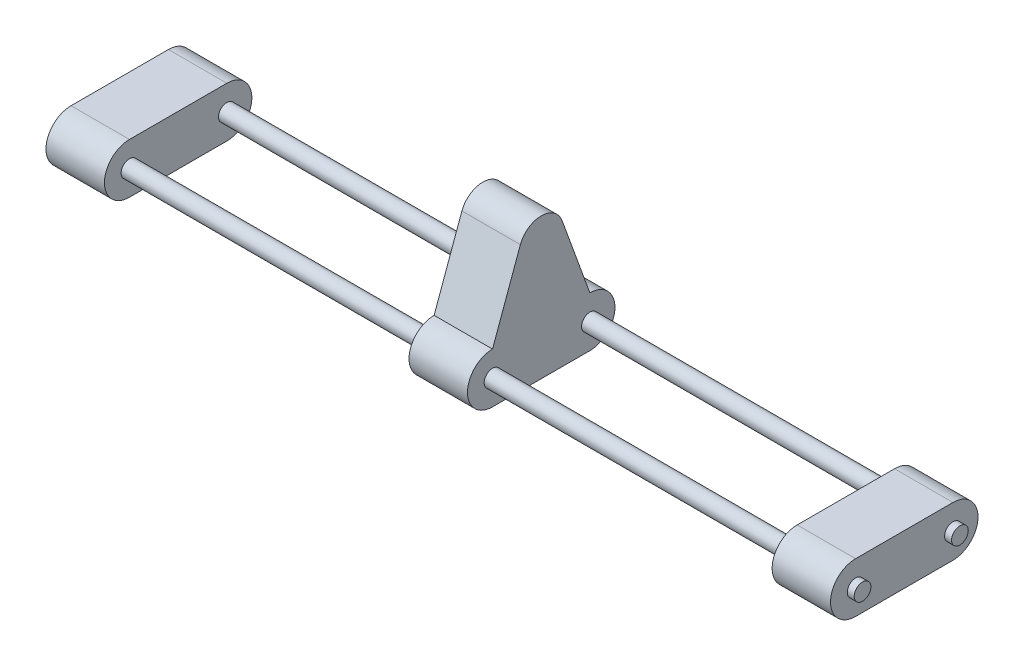
ISO-10303-21;
HEADER;
FILE_DESCRIPTION(('STEP AP214'),'2;1');
FILE_NAME('part.step','',(''),(''),'','','');
FILE_SCHEMA(('AUTOMOTIVE_DESIGN { 1 0 10303 214 1 1 1 1 }'));
ENDSEC;
DATA;
#1=APPLICATION_CONTEXT('core data for automotive mechanical design processes');
#2=APPLICATION_PROTOCOL_DEFINITION('international standard','automotive_design',2000,#1);
#3=PRODUCT_CONTEXT('',#1,'mechanical');
#4=PRODUCT('Part','Part','',(#3));
#5=PRODUCT_RELATED_PRODUCT_CATEGORY('part','',(#4));
#6=PRODUCT_DEFINITION_FORMATION('','',#4);
#7=PRODUCT_DEFINITION_CONTEXT('part definition',#1,'design');
#8=PRODUCT_DEFINITION('design','',#6,#7);
#9=PRODUCT_DEFINITION_SHAPE('','',#8);
#10=(LENGTH_UNIT() NAMED_UNIT(*) SI_UNIT(.MILLI.,.METRE.));
#11=(NAMED_UNIT(*) PLANE_ANGLE_UNIT() SI_UNIT($,.RADIAN.));
#12=(NAMED_UNIT(*) SI_UNIT($,.STERADIAN.) SOLID_ANGLE_UNIT());
#13=UNCERTAINTY_MEASURE_WITH_UNIT(LENGTH_MEASURE(1.E-05),#10,'distance_accuracy_value','');
#14=(GEOMETRIC_REPRESENTATION_CONTEXT(3) GLOBAL_UNCERTAINTY_ASSIGNED_CONTEXT((#13)) GLOBAL_UNIT_ASSIGNED_CONTEXT((#10,
#11,#12)) REPRESENTATION_CONTEXT('',''));
#15=CARTESIAN_POINT('',(0.,0.,0.));
#16=DIRECTION('',(0.,0.,1.));
#17=DIRECTION('',(1.,0.,0.));
#18=AXIS2_PLACEMENT_3D('',#15,#16,#17);
#19=CARTESIAN_POINT('',(47.9705627484772,0.,-35.));
#20=DIRECTION('',(-1.,0.,0.));
#21=DIRECTION('',(0.,0.,1.));
#22=AXIS2_PLACEMENT_3D('',#19,#20,#21);
#23=CYLINDRICAL_SURFACE('',#22,6.00000000000001);
#24=CARTESIAN_POINT('',(-282.,0.,-35.));
#25=DIRECTION('',(-1.,0.,0.));
#26=DIRECTION('',(0.,0.,1.));
#27=AXIS2_PLACEMENT_3D('',#24,#25,#26);
#28=CIRCLE('',#27,6.00000000000001);
#29=CARTESIAN_POINT('',(-282.,0.,-29.));
#30=VERTEX_POINT('',#29);
#31=EDGE_CURVE('E53',#30,#30,#28,.F.);
#32=ORIENTED_EDGE('',*,*,#31,.F.);
#33=EDGE_LOOP('',(#32));
#34=FACE_BOUND('',#33,.T.);
#35=CARTESIAN_POINT('',(-501.,0.,-35.));
#36=DIRECTION('',(1.,0.,0.));
#37=DIRECTION('',(0.,0.,-1.));
#38=AXIS2_PLACEMENT_3D('',#35,#36,#37);
#39=CIRCLE('',#38,6.);
#40=CARTESIAN_POINT('',(-501.,0.,-41.));
#41=VERTEX_POINT('',#40);
#42=EDGE_CURVE('E211',#41,#41,#39,.T.);
#43=ORIENTED_EDGE('',*,*,#42,.T.);
#44=EDGE_LOOP('',(#43));
#45=FACE_BOUND('',#44,.T.);
#46=ADVANCED_FACE('F43',(#34,#45),#23,.T.);
#47=CARTESIAN_POINT('',(-21.,0.,-35.));
#48=DIRECTION('',(1.,0.,0.));
#49=DIRECTION('',(0.,0.,-1.));
#50=AXIS2_PLACEMENT_3D('',#47,#48,#49);
#51=CIRCLE('',#50,6.00000000000001);
#52=CARTESIAN_POINT('',(-21.,0.,-41.));
#53=VERTEX_POINT('',#52);
#54=EDGE_CURVE('E320',#53,#53,#51,.T.);
#55=ORIENTED_EDGE('',*,*,#54,.F.);
#56=EDGE_LOOP('',(#55));
#57=FACE_BOUND('',#56,.T.);
#58=CARTESIAN_POINT('',(-240.,0.,-35.));
#59=DIRECTION('',(-1.,0.,0.));
#60=DIRECTION('',(0.,0.,1.));
#61=AXIS2_PLACEMENT_3D('',#58,#59,#60);
#62=CIRCLE('',#61,6.00000000000001);
#63=CARTESIAN_POINT('',(-240.,0.,-29.));
#64=VERTEX_POINT('',#63);
#65=EDGE_CURVE('E265',#64,#64,#62,.T.);
#66=ORIENTED_EDGE('',*,*,#65,.F.);
#67=EDGE_LOOP('',(#66));
#68=FACE_BOUND('',#67,.T.);
#69=ADVANCED_FACE('F372',(#57,#68),#23,.T.);
#70=CARTESIAN_POINT('',(21.,0.,35.));
#71=DIRECTION('',(1.,0.,0.));
#72=DIRECTION('',(0.,0.,-1.));
#73=AXIS2_PLACEMENT_3D('',#70,#71,#72);
#74=PLANE('',#73);
#75=CARTESIAN_POINT('',(21.,0.,35.));
#76=DIRECTION('',(1.,0.,0.));
#77=DIRECTION('',(0.,0.,-1.));
#78=AXIS2_PLACEMENT_3D('',#75,#76,#77);
#79=CIRCLE('',#78,6.);
#80=CARTESIAN_POINT('',(21.,0.,29.));
#81=VERTEX_POINT('',#80);
#82=EDGE_CURVE('E328',#81,#81,#79,.T.);
#83=ORIENTED_EDGE('',*,*,#82,.F.);
#84=EDGE_LOOP('',(#83));
#85=FACE_BOUND('',#84,.T.);
#86=CARTESIAN_POINT('',(21.,0.,35.));
#87=DIRECTION('',(1.,0.,0.));
#88=DIRECTION('',(0.,0.,-1.));
#89=AXIS2_PLACEMENT_3D('',#86,#87,#88);
#90=CIRCLE('',#89,18.);
#91=CARTESIAN_POINT('',(21.,18.,35.));
#92=VERTEX_POINT('',#91);
#93=CARTESIAN_POINT('',(21.,-18.,35.));
#94=VERTEX_POINT('',#93);
#95=EDGE_CURVE('E333',#92,#94,#90,.T.);
#96=ORIENTED_EDGE('',*,*,#95,.T.);
#97=DIRECTION('',(0.,0.,-1.));
#98=VECTOR('',#97,1.);
#99=CARTESIAN_POINT('',(21.,-18.,35.));
#100=LINE('',#99,#98);
#101=CARTESIAN_POINT('',(21.,-18.,-35.));
#102=VERTEX_POINT('',#101);
#103=EDGE_CURVE('E93',#94,#102,#100,.T.);
#104=ORIENTED_EDGE('',*,*,#103,.T.);
#105=CARTESIAN_POINT('',(21.,0.,-35.));
#106=DIRECTION('',(1.,0.,0.));
#107=DIRECTION('',(0.,0.,-1.));
#108=AXIS2_PLACEMENT_3D('',#105,#106,#107);
#109=CIRCLE('',#108,18.);
#110=CARTESIAN_POINT('',(21.,18.,-35.));
#111=VERTEX_POINT('',#110);
#112=EDGE_CURVE('E338',#102,#111,#109,.T.);
#113=ORIENTED_EDGE('',*,*,#112,.T.);
#114=DIRECTION('',(0.,0.,1.));
#115=VECTOR('',#114,1.);
#116=CARTESIAN_POINT('',(21.,18.,35.));
#117=LINE('',#116,#115);
#118=EDGE_CURVE('E61',#111,#92,#117,.T.);
#119=ORIENTED_EDGE('',*,*,#118,.T.);
#120=EDGE_LOOP('',(#96,#104,#113,#119));
#121=FACE_BOUND('',#120,.T.);
#122=CARTESIAN_POINT('',(21.,0.,-35.));
#123=DIRECTION('',(1.,0.,0.));
#124=DIRECTION('',(0.,0.,-1.));
#125=AXIS2_PLACEMENT_3D('',#122,#123,#124);
#126=CIRCLE('',#125,6.);
#127=CARTESIAN_POINT('',(21.,0.,-41.));
#128=VERTEX_POINT('',#127);
#129=EDGE_CURVE('E324',#128,#128,#126,.T.);
#130=ORIENTED_EDGE('',*,*,#129,.F.);
#131=EDGE_LOOP('',(#130));
#132=FACE_BOUND('',#131,.T.);
#133=ADVANCED_FACE('F441',(#85,#121,#132),#74,.T.);
#134=CARTESIAN_POINT('',(-21.,0.,35.));
#135=DIRECTION('',(1.,0.,0.));
#136=DIRECTION('',(0.,0.,-1.));
#137=AXIS2_PLACEMENT_3D('',#134,#135,#136);
#138=PLANE('',#137);
#139=CARTESIAN_POINT('',(-21.,0.,35.));
#140=DIRECTION('',(1.,0.,0.));
#141=DIRECTION('',(0.,0.,-1.));
#142=AXIS2_PLACEMENT_3D('',#139,#140,#141);
#143=CIRCLE('',#142,18.);
#144=CARTESIAN_POINT('',(-21.,18.,35.));
#145=VERTEX_POINT('',#144);
#146=CARTESIAN_POINT('',(-21.,-18.,35.));
#147=VERTEX_POINT('',#146);
#148=EDGE_CURVE('E332',#145,#147,#143,.T.);
#149=ORIENTED_EDGE('',*,*,#148,.F.);
#150=DIRECTION('',(0.,0.,1.));
#151=VECTOR('',#150,1.);
#152=CARTESIAN_POINT('',(-21.,18.,35.));
#153=LINE('',#152,#151);
#154=CARTESIAN_POINT('',(-21.,18.,-35.));
#155=VERTEX_POINT('',#154);
#156=EDGE_CURVE('E85',#155,#145,#153,.T.);
#157=ORIENTED_EDGE('',*,*,#156,.F.);
#158=CARTESIAN_POINT('',(-21.,0.,-35.));
#159=DIRECTION('',(1.,0.,0.));
#160=DIRECTION('',(0.,0.,-1.));
#161=AXIS2_PLACEMENT_3D('',#158,#159,#160);
#162=CIRCLE('',#161,18.);
#163=CARTESIAN_POINT('',(-21.,-18.,-35.));
#164=VERTEX_POINT('',#163);
#165=EDGE_CURVE('E79',#164,#155,#162,.T.);
#166=ORIENTED_EDGE('',*,*,#165,.F.);
#167=DIRECTION('',(0.,0.,-1.));
#168=VECTOR('',#167,1.);
#169=CARTESIAN_POINT('',(-21.,-18.,35.));
#170=LINE('',#169,#168);
#171=EDGE_CURVE('E347',#147,#164,#170,.T.);
#172=ORIENTED_EDGE('',*,*,#171,.F.);
#173=EDGE_LOOP('',(#149,#157,#166,#172));
#174=FACE_BOUND('',#173,.T.);
#175=CARTESIAN_POINT('',(-21.,0.,35.));
#176=DIRECTION('',(1.,0.,0.));
#177=DIRECTION('',(0.,0.,-1.));
#178=AXIS2_PLACEMENT_3D('',#175,#176,#177);
#179=CIRCLE('',#178,6.);
#180=CARTESIAN_POINT('',(-21.,0.,29.));
#181=VERTEX_POINT('',#180);
#182=EDGE_CURVE('E207',#181,#181,#179,.T.);
#183=ORIENTED_EDGE('',*,*,#182,.T.);
#184=EDGE_LOOP('',(#183));
#185=FACE_BOUND('',#184,.T.);
#186=ORIENTED_EDGE('',*,*,#54,.T.);
#187=EDGE_LOOP('',(#186));
#188=FACE_BOUND('',#187,.T.);
#189=ADVANCED_FACE('F444',(#174,#185,#188),#138,.F.);
#190=CARTESIAN_POINT('',(21.,0.,35.));
#191=DIRECTION('',(-1.,0.,0.));
#192=DIRECTION('',(0.,0.,1.));
#193=AXIS2_PLACEMENT_3D('',#190,#191,#192);
#194=CYLINDRICAL_SURFACE('',#193,18.);
#195=ORIENTED_EDGE('',*,*,#148,.T.);
#196=DIRECTION('',(-1.,0.,0.));
#197=VECTOR('',#196,1.);
#198=CARTESIAN_POINT('',(21.,-18.,35.));
#199=LINE('',#198,#197);
#200=EDGE_CURVE('E362',#94,#147,#199,.T.);
#201=ORIENTED_EDGE('',*,*,#200,.F.);
#202=ORIENTED_EDGE('',*,*,#95,.F.);
#203=DIRECTION('',(-1.,0.,0.));
#204=VECTOR('',#203,1.);
#205=CARTESIAN_POINT('',(21.,18.,35.));
#206=LINE('',#205,#204);
#207=EDGE_CURVE('E343',#92,#145,#206,.T.);
#208=ORIENTED_EDGE('',*,*,#207,.T.);
#209=EDGE_LOOP('',(#195,#201,#202,#208));
#210=FACE_BOUND('',#209,.T.);
#211=ADVANCED_FACE('F45',(#210),#194,.T.);
#212=CARTESIAN_POINT('',(21.,-18.,35.));
#213=DIRECTION('',(0.,1.,0.));
#214=DIRECTION('',(0.,0.,1.));
#215=AXIS2_PLACEMENT_3D('',#212,#213,#214);
#216=PLANE('',#215);
#217=ORIENTED_EDGE('',*,*,#171,.T.);
#218=DIRECTION('',(-1.,0.,0.));
#219=VECTOR('',#218,1.);
#220=CARTESIAN_POINT('',(21.,-18.,-35.));
#221=LINE('',#220,#219);
#222=EDGE_CURVE('E359',#102,#164,#221,.T.);
#223=ORIENTED_EDGE('',*,*,#222,.F.);
#224=ORIENTED_EDGE('',*,*,#103,.F.);
#225=ORIENTED_EDGE('',*,*,#200,.T.);
#226=EDGE_LOOP('',(#217,#223,#224,#225));
#227=FACE_BOUND('',#226,.T.);
#228=ADVANCED_FACE('F453',(#227),#216,.F.);
#229=CARTESIAN_POINT('',(21.,0.,-35.));
#230=DIRECTION('',(-1.,0.,0.));
#231=DIRECTION('',(0.,0.,1.));
#232=AXIS2_PLACEMENT_3D('',#229,#230,#231);
#233=CYLINDRICAL_SURFACE('',#232,18.);
#234=ORIENTED_EDGE('',*,*,#165,.T.);
#235=DIRECTION('',(-1.,0.,0.));
#236=VECTOR('',#235,1.);
#237=CARTESIAN_POINT('',(21.,18.,-35.));
#238=LINE('',#237,#236);
#239=EDGE_CURVE('E356',#111,#155,#238,.T.);
#240=ORIENTED_EDGE('',*,*,#239,.F.);
#241=ORIENTED_EDGE('',*,*,#112,.F.);
#242=ORIENTED_EDGE('',*,*,#222,.T.);
#243=EDGE_LOOP('',(#234,#240,#241,#242));
#244=FACE_BOUND('',#243,.T.);
#245=ADVANCED_FACE('F451',(#244),#233,.T.);
#246=CARTESIAN_POINT('',(21.,18.,35.));
#247=DIRECTION('',(0.,-1.,0.));
#248=DIRECTION('',(0.,0.,-1.));
#249=AXIS2_PLACEMENT_3D('',#246,#247,#248);
#250=PLANE('',#249);
#251=ORIENTED_EDGE('',*,*,#156,.T.);
#252=ORIENTED_EDGE('',*,*,#207,.F.);
#253=ORIENTED_EDGE('',*,*,#118,.F.);
#254=ORIENTED_EDGE('',*,*,#239,.T.);
#255=EDGE_LOOP('',(#251,#252,#253,#254));
#256=FACE_BOUND('',#255,.T.);
#257=ADVANCED_FACE('F439',(#256),#250,.F.);
#258=CARTESIAN_POINT('',(26.,0.,35.));
#259=DIRECTION('',(1.,0.,0.));
#260=DIRECTION('',(0.,0.,-1.));
#261=AXIS2_PLACEMENT_3D('',#258,#259,#260);
#262=PLANE('',#261);
#263=CARTESIAN_POINT('',(26.,0.,-35.));
#264=DIRECTION('',(1.,0.,0.));
#265=DIRECTION('',(0.,0.,-1.));
#266=AXIS2_PLACEMENT_3D('',#263,#264,#265);
#267=CIRCLE('',#266,6.00000000000001);
#268=CARTESIAN_POINT('',(26.,0.,-41.));
#269=VERTEX_POINT('',#268);
#270=EDGE_CURVE('E316',#269,#269,#267,.F.);
#271=ORIENTED_EDGE('',*,*,#270,.F.);
#272=EDGE_LOOP('',(#271));
#273=FACE_BOUND('',#272,.T.);
#274=ADVANCED_FACE('F435',(#273),#262,.T.);
#275=ORIENTED_EDGE('',*,*,#129,.T.);
#276=EDGE_LOOP('',(#275));
#277=FACE_BOUND('',#276,.T.);
#278=ORIENTED_EDGE('',*,*,#270,.T.);
#279=EDGE_LOOP('',(#278));
#280=FACE_BOUND('',#279,.T.);
#281=ADVANCED_FACE('F374',(#277,#280),#23,.T.);
#282=CARTESIAN_POINT('',(-282.,13.3430656934307,-36.6934306569343));
#283=DIRECTION('',(0.,-0.341743063086704,0.939793423488437));
#284=DIRECTION('',(0.,-0.939793423488437,-0.341743063086704));
#285=AXIS2_PLACEMENT_3D('',#282,#283,#284);
#286=PLANE('',#285);
#287=DIRECTION('',(0.,-0.939793423488437,-0.341743063086704));
#288=VECTOR('',#287,1.);
#289=CARTESIAN_POINT('',(-240.,13.3430656934307,-36.6934306569343));
#290=LINE('',#289,#288);
#291=CARTESIAN_POINT('',(-240.,73.,-15.));
#292=VERTEX_POINT('',#291);
#293=CARTESIAN_POINT('',(-240.,18.,-35.));
#294=VERTEX_POINT('',#293);
#295=EDGE_CURVE('E156',#292,#294,#290,.T.);
#296=ORIENTED_EDGE('',*,*,#295,.T.);
#297=DIRECTION('',(1.,0.,0.));
#298=VECTOR('',#297,1.);
#299=CARTESIAN_POINT('',(-282.,18.,-35.));
#300=LINE('',#299,#298);
#301=CARTESIAN_POINT('',(-282.,18.,-35.));
#302=VERTEX_POINT('',#301);
#303=EDGE_CURVE('E309',#302,#294,#300,.T.);
#304=ORIENTED_EDGE('',*,*,#303,.F.);
#305=DIRECTION('',(0.,-0.939793423488437,-0.341743063086704));
#306=VECTOR('',#305,1.);
#307=CARTESIAN_POINT('',(-282.,13.3430656934307,-36.6934306569343));
#308=LINE('',#307,#306);
#309=CARTESIAN_POINT('',(-282.,73.,-15.));
#310=VERTEX_POINT('',#309);
#311=EDGE_CURVE('E175',#310,#302,#308,.T.);
#312=ORIENTED_EDGE('',*,*,#311,.F.);
#313=DIRECTION('',(1.,0.,0.));
#314=VECTOR('',#313,1.);
#315=CARTESIAN_POINT('',(-282.,73.,-15.));
#316=LINE('',#315,#314);
#317=EDGE_CURVE('E172',#310,#292,#316,.T.);
#318=ORIENTED_EDGE('',*,*,#317,.T.);
#319=EDGE_LOOP('',(#296,#304,#312,#318));
#320=FACE_BOUND('',#319,.T.);
#321=ADVANCED_FACE('F173',(#320),#286,.F.);
#322=CARTESIAN_POINT('',(-282.,0.,-35.));
#323=DIRECTION('',(1.,0.,0.));
#324=DIRECTION('',(0.,0.,-1.));
#325=AXIS2_PLACEMENT_3D('',#322,#323,#324);
#326=CYLINDRICAL_SURFACE('',#325,18.);
#327=CARTESIAN_POINT('',(-240.,0.,-35.));
#328=DIRECTION('',(-1.,0.,0.));
#329=DIRECTION('',(0.,0.,1.));
#330=AXIS2_PLACEMENT_3D('',#327,#328,#329);
#331=CIRCLE('',#330,18.);
#332=CARTESIAN_POINT('',(-240.,-18.,-35.));
#333=VERTEX_POINT('',#332);
#334=EDGE_CURVE('E164',#294,#333,#331,.T.);
#335=ORIENTED_EDGE('',*,*,#334,.T.);
#336=DIRECTION('',(1.,0.,0.));
#337=VECTOR('',#336,1.);
#338=CARTESIAN_POINT('',(-282.,-18.,-35.));
#339=LINE('',#338,#337);
#340=CARTESIAN_POINT('',(-282.,-18.,-35.));
#341=VERTEX_POINT('',#340);
#342=EDGE_CURVE('E305',#341,#333,#339,.T.);
#343=ORIENTED_EDGE('',*,*,#342,.F.);
#344=CARTESIAN_POINT('',(-282.,0.,-35.));
#345=DIRECTION('',(-1.,0.,0.));
#346=DIRECTION('',(0.,0.,1.));
#347=AXIS2_PLACEMENT_3D('',#344,#345,#346);
#348=CIRCLE('',#347,18.);
#349=EDGE_CURVE('E264',#302,#341,#348,.T.);
#350=ORIENTED_EDGE('',*,*,#349,.F.);
#351=ORIENTED_EDGE('',*,*,#303,.T.);
#352=EDGE_LOOP('',(#335,#343,#350,#351));
#353=FACE_BOUND('',#352,.T.);
#354=ADVANCED_FACE('F423',(#353),#326,.T.);
#355=CARTESIAN_POINT('',(-282.,-18.,0.));
#356=DIRECTION('',(0.,1.,0.));
#357=DIRECTION('',(0.,0.,1.));
#358=AXIS2_PLACEMENT_3D('',#355,#356,#357);
#359=PLANE('',#358);
#360=DIRECTION('',(0.,0.,1.));
#361=VECTOR('',#360,1.);
#362=CARTESIAN_POINT('',(-240.,-18.,0.));
#363=LINE('',#362,#361);
#364=CARTESIAN_POINT('',(-240.,-18.,35.));
#365=VERTEX_POINT('',#364);
#366=EDGE_CURVE('E283',#333,#365,#363,.T.);
#367=ORIENTED_EDGE('',*,*,#366,.T.);
#368=DIRECTION('',(1.,0.,0.));
#369=VECTOR('',#368,1.);
#370=CARTESIAN_POINT('',(-282.,-18.,35.));
#371=LINE('',#370,#369);
#372=CARTESIAN_POINT('',(-282.,-18.,35.));
#373=VERTEX_POINT('',#372);
#374=EDGE_CURVE('E301',#373,#365,#371,.T.);
#375=ORIENTED_EDGE('',*,*,#374,.F.);
#376=DIRECTION('',(0.,0.,1.));
#377=VECTOR('',#376,1.);
#378=CARTESIAN_POINT('',(-282.,-18.,0.));
#379=LINE('',#378,#377);
#380=EDGE_CURVE('E268',#341,#373,#379,.T.);
#381=ORIENTED_EDGE('',*,*,#380,.F.);
#382=ORIENTED_EDGE('',*,*,#342,.T.);
#383=EDGE_LOOP('',(#367,#375,#381,#382));
#384=FACE_BOUND('',#383,.T.);
#385=ADVANCED_FACE('F419',(#384),#359,.F.);
#386=CARTESIAN_POINT('',(-282.,0.,35.));
#387=DIRECTION('',(1.,0.,0.));
#388=DIRECTION('',(0.,0.,-1.));
#389=AXIS2_PLACEMENT_3D('',#386,#387,#388);
#390=CYLINDRICAL_SURFACE('',#389,18.);
#391=CARTESIAN_POINT('',(-240.,0.,35.));
#392=DIRECTION('',(-1.,0.,0.));
#393=DIRECTION('',(0.,0.,1.));
#394=AXIS2_PLACEMENT_3D('',#391,#392,#393);
#395=CIRCLE('',#394,18.);
#396=CARTESIAN_POINT('',(-240.,18.,35.));
#397=VERTEX_POINT('',#396);
#398=EDGE_CURVE('E286',#365,#397,#395,.T.);
#399=ORIENTED_EDGE('',*,*,#398,.T.);
#400=DIRECTION('',(1.,0.,0.));
#401=VECTOR('',#400,1.);
#402=CARTESIAN_POINT('',(-282.,18.,35.));
#403=LINE('',#402,#401);
#404=CARTESIAN_POINT('',(-282.,18.,35.));
#405=VERTEX_POINT('',#404);
#406=EDGE_CURVE('E298',#405,#397,#403,.T.);
#407=ORIENTED_EDGE('',*,*,#406,.F.);
#408=CARTESIAN_POINT('',(-282.,0.,35.));
#409=DIRECTION('',(-1.,0.,0.));
#410=DIRECTION('',(0.,0.,1.));
#411=AXIS2_PLACEMENT_3D('',#408,#409,#410);
#412=CIRCLE('',#411,18.);
#413=EDGE_CURVE('E271',#373,#405,#412,.T.);
#414=ORIENTED_EDGE('',*,*,#413,.F.);
#415=ORIENTED_EDGE('',*,*,#374,.T.);
#416=EDGE_LOOP('',(#399,#407,#414,#415));
#417=FACE_BOUND('',#416,.T.);
#418=ADVANCED_FACE('F415',(#417),#390,.T.);
#419=CARTESIAN_POINT('',(-282.,13.3430656934307,36.6934306569343));
#420=DIRECTION('',(0.,0.341743063086704,0.939793423488437));
#421=DIRECTION('',(0.,-0.939793423488437,0.341743063086704));
#422=AXIS2_PLACEMENT_3D('',#419,#420,#421);
#423=PLANE('',#422);
#424=DIRECTION('',(0.,-0.939793423488437,0.341743063086704));
#425=VECTOR('',#424,1.);
#426=CARTESIAN_POINT('',(-240.,13.3430656934307,36.6934306569343));
#427=LINE('',#426,#425);
#428=CARTESIAN_POINT('',(-240.,73.0000000000001,15.));
#429=VERTEX_POINT('',#428);
#430=EDGE_CURVE('E290',#429,#397,#427,.T.);
#431=ORIENTED_EDGE('',*,*,#430,.F.);
#432=DIRECTION('',(1.,0.,0.));
#433=VECTOR('',#432,1.);
#434=CARTESIAN_POINT('',(-282.,73.0000000000001,15.));
#435=LINE('',#434,#433);
#436=CARTESIAN_POINT('',(-282.,73.0000000000001,15.));
#437=VERTEX_POINT('',#436);
#438=EDGE_CURVE('E180',#437,#429,#435,.T.);
#439=ORIENTED_EDGE('',*,*,#438,.F.);
#440=DIRECTION('',(0.,-0.939793423488437,0.341743063086704));
#441=VECTOR('',#440,1.);
#442=CARTESIAN_POINT('',(-282.,13.3430656934307,36.6934306569343));
#443=LINE('',#442,#441);
#444=EDGE_CURVE('E274',#437,#405,#443,.T.);
#445=ORIENTED_EDGE('',*,*,#444,.T.);
#446=ORIENTED_EDGE('',*,*,#406,.T.);
#447=EDGE_LOOP('',(#431,#439,#445,#446));
#448=FACE_BOUND('',#447,.T.);
#449=ADVANCED_FACE('F409',(#448),#423,.T.);
#450=CARTESIAN_POINT('',(-282.,0.,0.));
#451=DIRECTION('',(-1.,0.,0.));
#452=DIRECTION('',(0.,0.,1.));
#453=AXIS2_PLACEMENT_3D('',#450,#451,#452);
#454=PLANE('',#453);
#455=ORIENTED_EDGE('',*,*,#311,.T.);
#456=ORIENTED_EDGE('',*,*,#349,.T.);
#457=ORIENTED_EDGE('',*,*,#380,.T.);
#458=ORIENTED_EDGE('',*,*,#413,.T.);
#459=ORIENTED_EDGE('',*,*,#444,.F.);
#460=CARTESIAN_POINT('',(-282.,67.454288730655,0.));
#461=DIRECTION('',(1.,0.,0.));
#462=DIRECTION('',(0.,0.,-1.));
#463=AXIS2_PLACEMENT_3D('',#460,#461,#462);
#464=CIRCLE('',#463,15.9923392123523);
#465=EDGE_CURVE('E186',#437,#310,#464,.F.);
#466=ORIENTED_EDGE('',*,*,#465,.T.);
#467=EDGE_LOOP('',(#455,#456,#457,#458,#459,#466));
#468=FACE_BOUND('',#467,.T.);
#469=CARTESIAN_POINT('',(-282.,0.,35.));
#470=DIRECTION('',(-1.,0.,0.));
#471=DIRECTION('',(0.,0.,1.));
#472=AXIS2_PLACEMENT_3D('',#469,#470,#471);
#473=CIRCLE('',#472,6.);
#474=CARTESIAN_POINT('',(-282.,0.,41.));
#475=VERTEX_POINT('',#474);
#476=EDGE_CURVE('E181',#475,#475,#473,.T.);
#477=ORIENTED_EDGE('',*,*,#476,.F.);
#478=EDGE_LOOP('',(#477));
#479=FACE_BOUND('',#478,.T.);
#480=ORIENTED_EDGE('',*,*,#31,.T.);
#481=EDGE_LOOP('',(#480));
#482=FACE_BOUND('',#481,.T.);
#483=ADVANCED_FACE('F368',(#468,#479,#482),#454,.T.);
#484=CARTESIAN_POINT('',(-240.,0.,0.));
#485=DIRECTION('',(-1.,0.,0.));
#486=DIRECTION('',(0.,0.,1.));
#487=AXIS2_PLACEMENT_3D('',#484,#485,#486);
#488=PLANE('',#487);
#489=ORIENTED_EDGE('',*,*,#295,.F.);
#490=CARTESIAN_POINT('',(-240.,67.454288730655,0.));
#491=DIRECTION('',(1.,0.,0.));
#492=DIRECTION('',(0.,0.,-1.));
#493=AXIS2_PLACEMENT_3D('',#490,#491,#492);
#494=CIRCLE('',#493,15.9923392123523);
#495=EDGE_CURVE('E162',#429,#292,#494,.F.);
#496=ORIENTED_EDGE('',*,*,#495,.F.);
#497=ORIENTED_EDGE('',*,*,#430,.T.);
#498=ORIENTED_EDGE('',*,*,#398,.F.);
#499=ORIENTED_EDGE('',*,*,#366,.F.);
#500=ORIENTED_EDGE('',*,*,#334,.F.);
#501=EDGE_LOOP('',(#489,#496,#497,#498,#499,#500));
#502=FACE_BOUND('',#501,.T.);
#503=CARTESIAN_POINT('',(-240.,0.,35.));
#504=DIRECTION('',(-1.,0.,0.));
#505=DIRECTION('',(0.,0.,1.));
#506=AXIS2_PLACEMENT_3D('',#503,#504,#505);
#507=CIRCLE('',#506,6.);
#508=CARTESIAN_POINT('',(-240.,0.,41.));
#509=VERTEX_POINT('',#508);
#510=EDGE_CURVE('E203',#509,#509,#507,.T.);
#511=ORIENTED_EDGE('',*,*,#510,.T.);
#512=EDGE_LOOP('',(#511));
#513=FACE_BOUND('',#512,.T.);
#514=ORIENTED_EDGE('',*,*,#65,.T.);
#515=EDGE_LOOP('',(#514));
#516=FACE_BOUND('',#515,.T.);
#517=ADVANCED_FACE('F158',(#502,#513,#516),#488,.F.);
#518=CARTESIAN_POINT('',(-543.,0.,35.));
#519=DIRECTION('',(-1.,0.,0.));
#520=DIRECTION('',(0.,0.,-1.));
#521=AXIS2_PLACEMENT_3D('',#518,#519,#520);
#522=PLANE('',#521);
#523=CARTESIAN_POINT('',(-543.,0.,35.));
#524=DIRECTION('',(-1.,0.,0.));
#525=DIRECTION('',(0.,0.,1.));
#526=AXIS2_PLACEMENT_3D('',#523,#524,#525);
#527=CIRCLE('',#526,6.);
#528=CARTESIAN_POINT('',(-543.,0.,41.));
#529=VERTEX_POINT('',#528);
#530=EDGE_CURVE('E199',#529,#529,#527,.T.);
#531=ORIENTED_EDGE('',*,*,#530,.F.);
#532=EDGE_LOOP('',(#531));
#533=FACE_BOUND('',#532,.T.);
#534=CARTESIAN_POINT('',(-543.,0.,35.));
#535=DIRECTION('',(1.,0.,0.));
#536=DIRECTION('',(0.,0.,-1.));
#537=AXIS2_PLACEMENT_3D('',#534,#535,#536);
#538=CIRCLE('',#537,18.);
#539=CARTESIAN_POINT('',(-543.,18.,35.));
#540=VERTEX_POINT('',#539);
#541=CARTESIAN_POINT('',(-543.,-18.,35.));
#542=VERTEX_POINT('',#541);
#543=EDGE_CURVE('E220',#540,#542,#538,.T.);
#544=ORIENTED_EDGE('',*,*,#543,.F.);
#545=DIRECTION('',(0.,0.,1.));
#546=VECTOR('',#545,1.);
#547=CARTESIAN_POINT('',(-543.,18.,35.));
#548=LINE('',#547,#546);
#549=CARTESIAN_POINT('',(-543.,18.,-35.));
#550=VERTEX_POINT('',#549);
#551=EDGE_CURVE('E233',#550,#540,#548,.T.);
#552=ORIENTED_EDGE('',*,*,#551,.F.);
#553=CARTESIAN_POINT('',(-543.,0.,-35.));
#554=DIRECTION('',(1.,0.,0.));
#555=DIRECTION('',(0.,0.,-1.));
#556=AXIS2_PLACEMENT_3D('',#553,#554,#555);
#557=CIRCLE('',#556,18.);
#558=CARTESIAN_POINT('',(-543.,-18.,-35.));
#559=VERTEX_POINT('',#558);
#560=EDGE_CURVE('E229',#559,#550,#557,.T.);
#561=ORIENTED_EDGE('',*,*,#560,.F.);
#562=DIRECTION('',(0.,0.,-1.));
#563=VECTOR('',#562,1.);
#564=CARTESIAN_POINT('',(-543.,-18.,35.));
#565=LINE('',#564,#563);
#566=EDGE_CURVE('E224',#542,#559,#565,.T.);
#567=ORIENTED_EDGE('',*,*,#566,.F.);
#568=EDGE_LOOP('',(#544,#552,#561,#567));
#569=FACE_BOUND('',#568,.T.);
#570=CARTESIAN_POINT('',(-543.,0.,-35.));
#571=DIRECTION('',(-1.,0.,0.));
#572=DIRECTION('',(0.,0.,1.));
#573=AXIS2_PLACEMENT_3D('',#570,#571,#572);
#574=CIRCLE('',#573,6.00000000000001);
#575=CARTESIAN_POINT('',(-543.,0.,-29.));
#576=VERTEX_POINT('',#575);
#577=EDGE_CURVE('E12',#576,#576,#574,.F.);
#578=ORIENTED_EDGE('',*,*,#577,.T.);
#579=EDGE_LOOP('',(#578));
#580=FACE_BOUND('',#579,.T.);
#581=ADVANCED_FACE('F380',(#533,#569,#580),#522,.T.);
#582=CARTESIAN_POINT('',(-501.,0.,35.));
#583=DIRECTION('',(-1.,0.,0.));
#584=DIRECTION('',(0.,0.,-1.));
#585=AXIS2_PLACEMENT_3D('',#582,#583,#584);
#586=PLANE('',#585);
#587=CARTESIAN_POINT('',(-501.,0.,35.));
#588=DIRECTION('',(1.,0.,0.));
#589=DIRECTION('',(0.,0.,-1.));
#590=AXIS2_PLACEMENT_3D('',#587,#588,#589);
#591=CIRCLE('',#590,18.);
#592=CARTESIAN_POINT('',(-501.,18.,35.));
#593=VERTEX_POINT('',#592);
#594=CARTESIAN_POINT('',(-501.,-18.,35.));
#595=VERTEX_POINT('',#594);
#596=EDGE_CURVE('E219',#593,#595,#591,.T.);
#597=ORIENTED_EDGE('',*,*,#596,.T.);
#598=DIRECTION('',(0.,0.,-1.));
#599=VECTOR('',#598,1.);
#600=CARTESIAN_POINT('',(-501.,-18.,35.));
#601=LINE('',#600,#599);
#602=CARTESIAN_POINT('',(-501.,-18.,-35.));
#603=VERTEX_POINT('',#602);
#604=EDGE_CURVE('E241',#595,#603,#601,.T.);
#605=ORIENTED_EDGE('',*,*,#604,.T.);
#606=CARTESIAN_POINT('',(-501.,0.,-35.));
#607=DIRECTION('',(1.,0.,0.));
#608=DIRECTION('',(0.,0.,-1.));
#609=AXIS2_PLACEMENT_3D('',#606,#607,#608);
#610=CIRCLE('',#609,18.);
#611=CARTESIAN_POINT('',(-501.,18.,-35.));
#612=VERTEX_POINT('',#611);
#613=EDGE_CURVE('E245',#603,#612,#610,.T.);
#614=ORIENTED_EDGE('',*,*,#613,.T.);
#615=DIRECTION('',(0.,0.,1.));
#616=VECTOR('',#615,1.);
#617=CARTESIAN_POINT('',(-501.,18.,35.));
#618=LINE('',#617,#616);
#619=EDGE_CURVE('E225',#612,#593,#618,.T.);
#620=ORIENTED_EDGE('',*,*,#619,.T.);
#621=EDGE_LOOP('',(#597,#605,#614,#620));
#622=FACE_BOUND('',#621,.T.);
#623=CARTESIAN_POINT('',(-501.,0.,35.));
#624=DIRECTION('',(1.,0.,0.));
#625=DIRECTION('',(0.,0.,-1.));
#626=AXIS2_PLACEMENT_3D('',#623,#624,#625);
#627=CIRCLE('',#626,6.);
#628=CARTESIAN_POINT('',(-501.,0.,29.));
#629=VERTEX_POINT('',#628);
#630=EDGE_CURVE('E215',#629,#629,#627,.T.);
#631=ORIENTED_EDGE('',*,*,#630,.F.);
#632=EDGE_LOOP('',(#631));
#633=FACE_BOUND('',#632,.T.);
#634=ORIENTED_EDGE('',*,*,#42,.F.);
#635=EDGE_LOOP('',(#634));
#636=FACE_BOUND('',#635,.T.);
#637=ADVANCED_FACE('F377',(#622,#633,#636),#586,.F.);
#638=CARTESIAN_POINT('',(-543.,0.,35.));
#639=DIRECTION('',(1.,0.,0.));
#640=DIRECTION('',(0.,0.,1.));
#641=AXIS2_PLACEMENT_3D('',#638,#639,#640);
#642=CYLINDRICAL_SURFACE('',#641,18.);
#643=ORIENTED_EDGE('',*,*,#596,.F.);
#644=DIRECTION('',(1.,0.,0.));
#645=VECTOR('',#644,1.);
#646=CARTESIAN_POINT('',(-543.,18.,35.));
#647=LINE('',#646,#645);
#648=EDGE_CURVE('E237',#540,#593,#647,.T.);
#649=ORIENTED_EDGE('',*,*,#648,.F.);
#650=ORIENTED_EDGE('',*,*,#543,.T.);
#651=DIRECTION('',(1.,0.,0.));
#652=VECTOR('',#651,1.);
#653=CARTESIAN_POINT('',(-543.,-18.,35.));
#654=LINE('',#653,#652);
#655=EDGE_CURVE('E169',#542,#595,#654,.T.);
#656=ORIENTED_EDGE('',*,*,#655,.T.);
#657=EDGE_LOOP('',(#643,#649,#650,#656));
#658=FACE_BOUND('',#657,.T.);
#659=ADVANCED_FACE('F379',(#658),#642,.T.);
#660=CARTESIAN_POINT('',(-543.,-18.,35.));
#661=DIRECTION('',(0.,1.,0.));
#662=DIRECTION('',(0.,0.,1.));
#663=AXIS2_PLACEMENT_3D('',#660,#661,#662);
#664=PLANE('',#663);
#665=ORIENTED_EDGE('',*,*,#604,.F.);
#666=ORIENTED_EDGE('',*,*,#655,.F.);
#667=ORIENTED_EDGE('',*,*,#566,.T.);
#668=DIRECTION('',(1.,0.,0.));
#669=VECTOR('',#668,1.);
#670=CARTESIAN_POINT('',(-543.,-18.,-35.));
#671=LINE('',#670,#669);
#672=EDGE_CURVE('E257',#559,#603,#671,.T.);
#673=ORIENTED_EDGE('',*,*,#672,.T.);
#674=EDGE_LOOP('',(#665,#666,#667,#673));
#675=FACE_BOUND('',#674,.T.);
#676=ADVANCED_FACE('F387',(#675),#664,.F.);
#677=CARTESIAN_POINT('',(-543.,0.,-35.));
#678=DIRECTION('',(1.,0.,0.));
#679=DIRECTION('',(0.,0.,1.));
#680=AXIS2_PLACEMENT_3D('',#677,#678,#679);
#681=CYLINDRICAL_SURFACE('',#680,18.);
#682=ORIENTED_EDGE('',*,*,#613,.F.);
#683=ORIENTED_EDGE('',*,*,#672,.F.);
#684=ORIENTED_EDGE('',*,*,#560,.T.);
#685=DIRECTION('',(1.,0.,0.));
#686=VECTOR('',#685,1.);
#687=CARTESIAN_POINT('',(-543.,18.,-35.));
#688=LINE('',#687,#686);
#689=EDGE_CURVE('E254',#550,#612,#688,.T.);
#690=ORIENTED_EDGE('',*,*,#689,.T.);
#691=EDGE_LOOP('',(#682,#683,#684,#690));
#692=FACE_BOUND('',#691,.T.);
#693=ADVANCED_FACE('F399',(#692),#681,.T.);
#694=CARTESIAN_POINT('',(-543.,18.,35.));
#695=DIRECTION('',(0.,-1.,0.));
#696=DIRECTION('',(0.,0.,-1.));
#697=AXIS2_PLACEMENT_3D('',#694,#695,#696);
#698=PLANE('',#697);
#699=ORIENTED_EDGE('',*,*,#619,.F.);
#700=ORIENTED_EDGE('',*,*,#689,.F.);
#701=ORIENTED_EDGE('',*,*,#551,.T.);
#702=ORIENTED_EDGE('',*,*,#648,.T.);
#703=EDGE_LOOP('',(#699,#700,#701,#702));
#704=FACE_BOUND('',#703,.T.);
#705=ADVANCED_FACE('F395',(#704),#698,.F.);
#706=CARTESIAN_POINT('',(-548.,0.,35.));
#707=DIRECTION('',(-1.,0.,0.));
#708=DIRECTION('',(0.,0.,-1.));
#709=AXIS2_PLACEMENT_3D('',#706,#707,#708);
#710=PLANE('',#709);
#711=CARTESIAN_POINT('',(-548.,0.,-35.));
#712=DIRECTION('',(-1.,0.,0.));
#713=DIRECTION('',(0.,0.,1.));
#714=AXIS2_PLACEMENT_3D('',#711,#712,#713);
#715=CIRCLE('',#714,6.00000000000001);
#716=CARTESIAN_POINT('',(-548.,0.,-29.));
#717=VERTEX_POINT('',#716);
#718=EDGE_CURVE('E312',#717,#717,#715,.T.);
#719=ORIENTED_EDGE('',*,*,#718,.T.);
#720=EDGE_LOOP('',(#719));
#721=FACE_BOUND('',#720,.T.);
#722=ADVANCED_FACE('F398',(#721),#710,.T.);
#723=ORIENTED_EDGE('',*,*,#577,.F.);
#724=EDGE_LOOP('',(#723));
#725=FACE_BOUND('',#724,.T.);
#726=ORIENTED_EDGE('',*,*,#718,.F.);
#727=EDGE_LOOP('',(#726));
#728=FACE_BOUND('',#727,.T.);
#729=ADVANCED_FACE('F431',(#725,#728),#23,.T.);
#730=CARTESIAN_POINT('',(47.9705627484772,0.,35.));
#731=DIRECTION('',(-1.,0.,0.));
#732=DIRECTION('',(0.,0.,1.));
#733=AXIS2_PLACEMENT_3D('',#730,#731,#732);
#734=CYLINDRICAL_SURFACE('',#733,6.);
#735=ORIENTED_EDGE('',*,*,#476,.T.);
#736=EDGE_LOOP('',(#735));
#737=FACE_BOUND('',#736,.T.);
#738=ORIENTED_EDGE('',*,*,#630,.T.);
#739=EDGE_LOOP('',(#738));
#740=FACE_BOUND('',#739,.T.);
#741=ADVANCED_FACE('F479',(#737,#740),#734,.T.);
#742=CARTESIAN_POINT('',(-548.,0.,35.));
#743=DIRECTION('',(-1.,0.,0.));
#744=DIRECTION('',(0.,0.,-1.));
#745=AXIS2_PLACEMENT_3D('',#742,#743,#744);
#746=PLANE('',#745);
#747=CARTESIAN_POINT('',(-548.,0.,35.));
#748=DIRECTION('',(-1.,0.,0.));
#749=DIRECTION('',(0.,0.,1.));
#750=AXIS2_PLACEMENT_3D('',#747,#748,#749);
#751=CIRCLE('',#750,6.);
#752=CARTESIAN_POINT('',(-548.,0.,41.));
#753=VERTEX_POINT('',#752);
#754=EDGE_CURVE('E189',#753,#753,#751,.T.);
#755=ORIENTED_EDGE('',*,*,#754,.T.);
#756=EDGE_LOOP('',(#755));
#757=FACE_BOUND('',#756,.T.);
#758=ADVANCED_FACE('F484',(#757),#746,.T.);
#759=ORIENTED_EDGE('',*,*,#530,.T.);
#760=EDGE_LOOP('',(#759));
#761=FACE_BOUND('',#760,.T.);
#762=ORIENTED_EDGE('',*,*,#754,.F.);
#763=EDGE_LOOP('',(#762));
#764=FACE_BOUND('',#763,.T.);
#765=ADVANCED_FACE('F487',(#761,#764),#734,.T.);
#766=ORIENTED_EDGE('',*,*,#510,.F.);
#767=EDGE_LOOP('',(#766));
#768=FACE_BOUND('',#767,.T.);
#769=ORIENTED_EDGE('',*,*,#182,.F.);
#770=EDGE_LOOP('',(#769));
#771=FACE_BOUND('',#770,.T.);
#772=ADVANCED_FACE('F500',(#768,#771),#734,.T.);
#773=ORIENTED_EDGE('',*,*,#82,.T.);
#774=EDGE_LOOP('',(#773));
#775=FACE_BOUND('',#774,.T.);
#776=CARTESIAN_POINT('',(26.,0.,35.));
#777=DIRECTION('',(1.,0.,0.));
#778=DIRECTION('',(0.,0.,-1.));
#779=AXIS2_PLACEMENT_3D('',#776,#777,#778);
#780=CIRCLE('',#779,6.);
#781=CARTESIAN_POINT('',(26.,0.,29.));
#782=VERTEX_POINT('',#781);
#783=EDGE_CURVE('E195',#782,#782,#780,.F.);
#784=ORIENTED_EDGE('',*,*,#783,.T.);
#785=EDGE_LOOP('',(#784));
#786=FACE_BOUND('',#785,.T.);
#787=ADVANCED_FACE('F488',(#775,#786),#734,.T.);
#788=CARTESIAN_POINT('',(26.,0.,35.));
#789=DIRECTION('',(1.,0.,0.));
#790=DIRECTION('',(0.,0.,-1.));
#791=AXIS2_PLACEMENT_3D('',#788,#789,#790);
#792=PLANE('',#791);
#793=ORIENTED_EDGE('',*,*,#783,.F.);
#794=EDGE_LOOP('',(#793));
#795=FACE_BOUND('',#794,.T.);
#796=ADVANCED_FACE('F503',(#795),#792,.T.);
#797=CARTESIAN_POINT('',(-282.,67.454288730655,0.));
#798=DIRECTION('',(1.,0.,0.));
#799=DIRECTION('',(0.,0.,-1.));
#800=AXIS2_PLACEMENT_3D('',#797,#798,#799);
#801=CYLINDRICAL_SURFACE('',#800,15.9923392123523);
#802=ORIENTED_EDGE('',*,*,#495,.T.);
#803=ORIENTED_EDGE('',*,*,#317,.F.);
#804=ORIENTED_EDGE('',*,*,#465,.F.);
#805=ORIENTED_EDGE('',*,*,#438,.T.);
#806=EDGE_LOOP('',(#802,#803,#804,#805));
#807=FACE_BOUND('',#806,.T.);
#808=ADVANCED_FACE('F184',(#807),#801,.T.);
#809=CLOSED_SHELL('',(#46,#69,#133,#189,#211,#228,#245,#257,#274,#281,#321,#354,#385,#418,#449,
#483,#517,#581,#637,#659,#676,#693,#705,#722,#729,#741,#758,#765,#772,#787,#796,#808));
#810=MANIFOLD_SOLID_BREP('B2',#809);
#811=ADVANCED_BREP_SHAPE_REPRESENTATION('',(#18,#810),#14);
#812=SHAPE_DEFINITION_REPRESENTATION(#9,#811);
ENDSEC;
END-ISO-10303-21;
